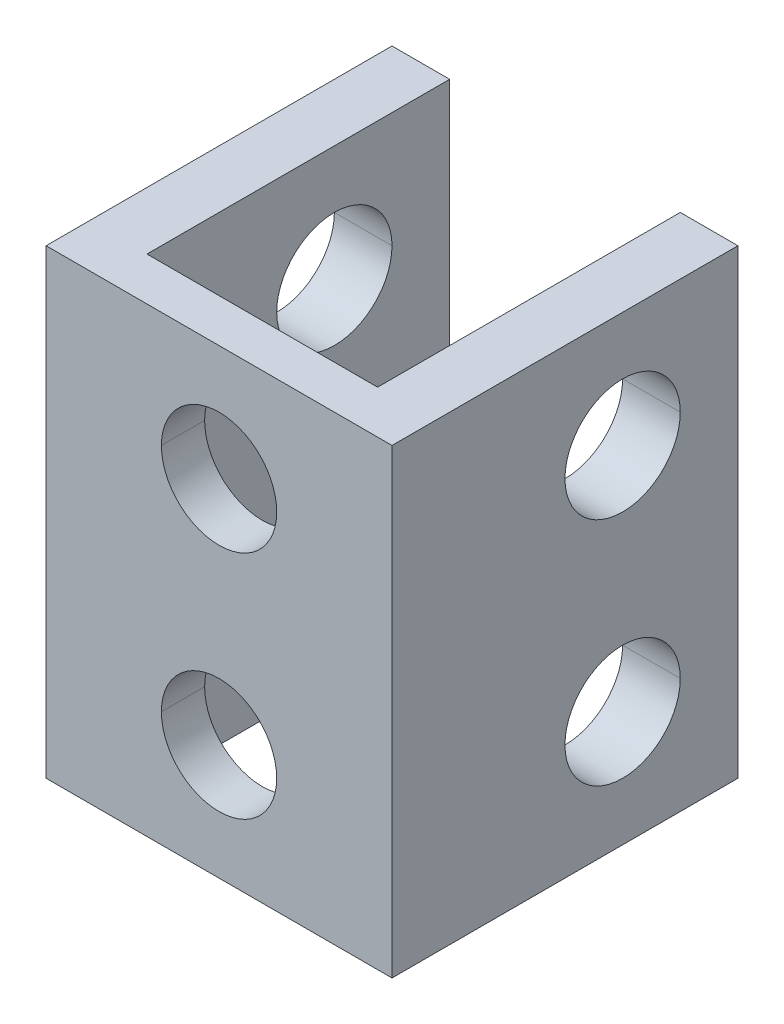
ISO-10303-21;
HEADER;
FILE_DESCRIPTION(('STEP AP214'),'2;1');
FILE_NAME('part.step','',(''),(''),'','','');
FILE_SCHEMA(('AUTOMOTIVE_DESIGN { 1 0 10303 214 1 1 1 1 }'));
ENDSEC;
DATA;
#1=APPLICATION_CONTEXT('core data for automotive mechanical design processes');
#2=APPLICATION_PROTOCOL_DEFINITION('international standard','automotive_design',2000,#1);
#3=PRODUCT_CONTEXT('',#1,'mechanical');
#4=PRODUCT('Part','Part','',(#3));
#5=PRODUCT_RELATED_PRODUCT_CATEGORY('part','',(#4));
#6=PRODUCT_DEFINITION_FORMATION('','',#4);
#7=PRODUCT_DEFINITION_CONTEXT('part definition',#1,'design');
#8=PRODUCT_DEFINITION('design','',#6,#7);
#9=PRODUCT_DEFINITION_SHAPE('','',#8);
#10=(LENGTH_UNIT() NAMED_UNIT(*) SI_UNIT(.MILLI.,.METRE.));
#11=(NAMED_UNIT(*) PLANE_ANGLE_UNIT() SI_UNIT($,.RADIAN.));
#12=(NAMED_UNIT(*) SI_UNIT($,.STERADIAN.) SOLID_ANGLE_UNIT());
#13=UNCERTAINTY_MEASURE_WITH_UNIT(LENGTH_MEASURE(1.E-05),#10,'distance_accuracy_value','');
#14=(GEOMETRIC_REPRESENTATION_CONTEXT(3) GLOBAL_UNCERTAINTY_ASSIGNED_CONTEXT((#13)) GLOBAL_UNIT_ASSIGNED_CONTEXT((#10,
#11,#12)) REPRESENTATION_CONTEXT('',''));
#15=CARTESIAN_POINT('',(0.,0.,0.));
#16=DIRECTION('',(0.,0.,1.));
#17=DIRECTION('',(1.,0.,0.));
#18=AXIS2_PLACEMENT_3D('',#15,#16,#17);
#19=CARTESIAN_POINT('',(0.,12.,1.5));
#20=DIRECTION('',(0.,0.,1.));
#21=DIRECTION('',(1.,0.,0.));
#22=AXIS2_PLACEMENT_3D('',#19,#20,#21);
#23=CYLINDRICAL_SURFACE('',#22,2.);
#24=DIRECTION('',(0.,0.,1.));
#25=VECTOR('',#24,1.);
#26=CARTESIAN_POINT('',(-2.,12.,1.5));
#27=LINE('',#26,#25);
#28=CARTESIAN_POINT('',(-2.,12.,0.));
#29=VERTEX_POINT('',#28);
#30=CARTESIAN_POINT('',(-2.,12.,1.5));
#31=VERTEX_POINT('',#30);
#32=EDGE_CURVE('E295',#29,#31,#27,.T.);
#33=ORIENTED_EDGE('',*,*,#32,.F.);
#34=CARTESIAN_POINT('',(0.,12.,0.));
#35=DIRECTION('',(0.,0.,1.));
#36=DIRECTION('',(1.,0.,0.));
#37=AXIS2_PLACEMENT_3D('',#34,#35,#36);
#38=CIRCLE('',#37,2.);
#39=CARTESIAN_POINT('',(2.,12.,0.));
#40=VERTEX_POINT('',#39);
#41=EDGE_CURVE('E26',#40,#29,#38,.T.);
#42=ORIENTED_EDGE('',*,*,#41,.F.);
#43=DIRECTION('',(0.,0.,1.));
#44=VECTOR('',#43,1.);
#45=CARTESIAN_POINT('',(2.,12.,1.5));
#46=LINE('',#45,#44);
#47=CARTESIAN_POINT('',(2.,12.,1.5));
#48=VERTEX_POINT('',#47);
#49=EDGE_CURVE('E271',#40,#48,#46,.T.);
#50=ORIENTED_EDGE('',*,*,#49,.T.);
#51=CARTESIAN_POINT('',(0.,12.,1.5));
#52=DIRECTION('',(0.,0.,1.));
#53=DIRECTION('',(1.,0.,0.));
#54=AXIS2_PLACEMENT_3D('',#51,#52,#53);
#55=CIRCLE('',#54,2.);
#56=EDGE_CURVE('E367',#48,#31,#55,.T.);
#57=ORIENTED_EDGE('',*,*,#56,.T.);
#58=EDGE_LOOP('',(#33,#42,#50,#57));
#59=FACE_BOUND('',#58,.T.);
#60=ADVANCED_FACE('F15',(#59),#23,.F.);
#61=CARTESIAN_POINT('',(-6.,12.,-6.5));
#62=DIRECTION('',(-1.,0.,0.));
#63=DIRECTION('',(0.,0.,1.));
#64=AXIS2_PLACEMENT_3D('',#61,#62,#63);
#65=CYLINDRICAL_SURFACE('',#64,2.);
#66=DIRECTION('',(-1.,0.,0.));
#67=VECTOR('',#66,1.);
#68=CARTESIAN_POINT('',(-6.,12.,-8.5));
#69=LINE('',#68,#67);
#70=CARTESIAN_POINT('',(6.,12.,-8.5));
#71=VERTEX_POINT('',#70);
#72=CARTESIAN_POINT('',(4.,12.,-8.5));
#73=VERTEX_POINT('',#72);
#74=EDGE_CURVE('E348',#71,#73,#69,.T.);
#75=ORIENTED_EDGE('',*,*,#74,.F.);
#76=CARTESIAN_POINT('',(6.,12.,-6.5));
#77=DIRECTION('',(-1.,0.,0.));
#78=DIRECTION('',(0.,0.,1.));
#79=AXIS2_PLACEMENT_3D('',#76,#77,#78);
#80=CIRCLE('',#79,2.);
#81=CARTESIAN_POINT('',(6.,12.,-4.5));
#82=VERTEX_POINT('',#81);
#83=EDGE_CURVE('E250',#82,#71,#80,.T.);
#84=ORIENTED_EDGE('',*,*,#83,.F.);
#85=DIRECTION('',(-1.,0.,0.));
#86=VECTOR('',#85,1.);
#87=CARTESIAN_POINT('',(-6.,12.,-4.5));
#88=LINE('',#87,#86);
#89=CARTESIAN_POINT('',(4.,12.,-4.5));
#90=VERTEX_POINT('',#89);
#91=EDGE_CURVE('E337',#82,#90,#88,.T.);
#92=ORIENTED_EDGE('',*,*,#91,.T.);
#93=CARTESIAN_POINT('',(4.,12.,-6.5));
#94=DIRECTION('',(1.,0.,0.));
#95=DIRECTION('',(0.,0.,-1.));
#96=AXIS2_PLACEMENT_3D('',#93,#94,#95);
#97=CIRCLE('',#96,2.);
#98=EDGE_CURVE('E341',#73,#90,#97,.T.);
#99=ORIENTED_EDGE('',*,*,#98,.F.);
#100=EDGE_LOOP('',(#75,#84,#92,#99));
#101=FACE_BOUND('',#100,.T.);
#102=ADVANCED_FACE('F481',(#101),#65,.F.);
#103=CARTESIAN_POINT('',(-6.,12.,-6.5));
#104=DIRECTION('',(-1.,0.,0.));
#105=DIRECTION('',(0.,0.,1.));
#106=AXIS2_PLACEMENT_3D('',#103,#104,#105);
#107=CYLINDRICAL_SURFACE('',#106,2.);
#108=DIRECTION('',(-1.,0.,0.));
#109=VECTOR('',#108,1.);
#110=CARTESIAN_POINT('',(-6.,12.,-8.5));
#111=LINE('',#110,#109);
#112=CARTESIAN_POINT('',(-4.,12.,-8.5));
#113=VERTEX_POINT('',#112);
#114=CARTESIAN_POINT('',(-6.,12.,-8.5));
#115=VERTEX_POINT('',#114);
#116=EDGE_CURVE('E266',#113,#115,#111,.T.);
#117=ORIENTED_EDGE('',*,*,#116,.F.);
#118=CARTESIAN_POINT('',(-4.,12.,-6.5));
#119=DIRECTION('',(-1.,0.,0.));
#120=DIRECTION('',(0.,0.,1.));
#121=AXIS2_PLACEMENT_3D('',#118,#119,#120);
#122=CIRCLE('',#121,2.);
#123=CARTESIAN_POINT('',(-4.,12.,-4.5));
#124=VERTEX_POINT('',#123);
#125=EDGE_CURVE('E185',#124,#113,#122,.T.);
#126=ORIENTED_EDGE('',*,*,#125,.F.);
#127=DIRECTION('',(-1.,0.,0.));
#128=VECTOR('',#127,1.);
#129=CARTESIAN_POINT('',(-6.,12.,-4.5));
#130=LINE('',#129,#128);
#131=CARTESIAN_POINT('',(-6.,12.,-4.5));
#132=VERTEX_POINT('',#131);
#133=EDGE_CURVE('E239',#124,#132,#130,.T.);
#134=ORIENTED_EDGE('',*,*,#133,.T.);
#135=CARTESIAN_POINT('',(-6.,12.,-6.5));
#136=DIRECTION('',(-1.,0.,0.));
#137=DIRECTION('',(0.,0.,1.));
#138=AXIS2_PLACEMENT_3D('',#135,#136,#137);
#139=CIRCLE('',#138,2.);
#140=EDGE_CURVE('E308',#132,#115,#139,.T.);
#141=ORIENTED_EDGE('',*,*,#140,.T.);
#142=EDGE_LOOP('',(#117,#126,#134,#141));
#143=FACE_BOUND('',#142,.T.);
#144=ADVANCED_FACE('F487',(#143),#107,.F.);
#145=CARTESIAN_POINT('',(0.,16.,0.));
#146=DIRECTION('',(0.,1.,0.));
#147=DIRECTION('',(1.,0.,0.));
#148=AXIS2_PLACEMENT_3D('',#145,#146,#147);
#149=PLANE('',#148);
#150=DIRECTION('',(0.,0.,-1.));
#151=VECTOR('',#150,1.);
#152=CARTESIAN_POINT('',(-4.,16.,0.));
#153=LINE('',#152,#151);
#154=CARTESIAN_POINT('',(-4.,16.,0.));
#155=VERTEX_POINT('',#154);
#156=CARTESIAN_POINT('',(-4.,16.,-10.5));
#157=VERTEX_POINT('',#156);
#158=EDGE_CURVE('E298',#155,#157,#153,.T.);
#159=ORIENTED_EDGE('',*,*,#158,.T.);
#160=DIRECTION('',(-1.,0.,0.));
#161=VECTOR('',#160,1.);
#162=CARTESIAN_POINT('',(-4.,16.,-10.5));
#163=LINE('',#162,#161);
#164=CARTESIAN_POINT('',(-6.,16.,-10.5));
#165=VERTEX_POINT('',#164);
#166=EDGE_CURVE('E240',#157,#165,#163,.T.);
#167=ORIENTED_EDGE('',*,*,#166,.T.);
#168=DIRECTION('',(0.,0.,1.));
#169=VECTOR('',#168,1.);
#170=CARTESIAN_POINT('',(-6.,16.,-10.5));
#171=LINE('',#170,#169);
#172=CARTESIAN_POINT('',(-6.,16.,1.5));
#173=VERTEX_POINT('',#172);
#174=EDGE_CURVE('E255',#165,#173,#171,.T.);
#175=ORIENTED_EDGE('',*,*,#174,.T.);
#176=DIRECTION('',(1.,0.,0.));
#177=VECTOR('',#176,1.);
#178=CARTESIAN_POINT('',(-6.,16.,1.5));
#179=LINE('',#178,#177);
#180=CARTESIAN_POINT('',(6.,16.,1.5));
#181=VERTEX_POINT('',#180);
#182=EDGE_CURVE('E259',#173,#181,#179,.T.);
#183=ORIENTED_EDGE('',*,*,#182,.T.);
#184=DIRECTION('',(0.,0.,-1.));
#185=VECTOR('',#184,1.);
#186=CARTESIAN_POINT('',(6.,16.,-10.5));
#187=LINE('',#186,#185);
#188=CARTESIAN_POINT('',(6.,16.,-10.5));
#189=VERTEX_POINT('',#188);
#190=EDGE_CURVE('E246',#181,#189,#187,.T.);
#191=ORIENTED_EDGE('',*,*,#190,.T.);
#192=DIRECTION('',(-1.,0.,0.));
#193=VECTOR('',#192,1.);
#194=CARTESIAN_POINT('',(4.,16.,-10.5));
#195=LINE('',#194,#193);
#196=CARTESIAN_POINT('',(4.,16.,-10.5));
#197=VERTEX_POINT('',#196);
#198=EDGE_CURVE('E315',#189,#197,#195,.T.);
#199=ORIENTED_EDGE('',*,*,#198,.T.);
#200=DIRECTION('',(0.,0.,1.));
#201=VECTOR('',#200,1.);
#202=CARTESIAN_POINT('',(4.,16.,0.));
#203=LINE('',#202,#201);
#204=CARTESIAN_POINT('',(4.,16.,0.));
#205=VERTEX_POINT('',#204);
#206=EDGE_CURVE('E229',#197,#205,#203,.T.);
#207=ORIENTED_EDGE('',*,*,#206,.T.);
#208=DIRECTION('',(-1.,0.,0.));
#209=VECTOR('',#208,1.);
#210=CARTESIAN_POINT('',(4.,16.,0.));
#211=LINE('',#210,#209);
#212=EDGE_CURVE('E41',#205,#155,#211,.T.);
#213=ORIENTED_EDGE('',*,*,#212,.T.);
#214=EDGE_LOOP('',(#159,#167,#175,#183,#191,#199,#207,#213));
#215=FACE_BOUND('',#214,.T.);
#216=ADVANCED_FACE('F524',(#215),#149,.T.);
#217=CARTESIAN_POINT('',(0.,4.,1.5));
#218=DIRECTION('',(0.,0.,1.));
#219=DIRECTION('',(1.,0.,0.));
#220=AXIS2_PLACEMENT_3D('',#217,#218,#219);
#221=CYLINDRICAL_SURFACE('',#220,2.);
#222=DIRECTION('',(0.,0.,1.));
#223=VECTOR('',#222,1.);
#224=CARTESIAN_POINT('',(-2.,4.,1.5));
#225=LINE('',#224,#223);
#226=CARTESIAN_POINT('',(-2.,4.,0.));
#227=VERTEX_POINT('',#226);
#228=CARTESIAN_POINT('',(-2.,4.,1.5));
#229=VERTEX_POINT('',#228);
#230=EDGE_CURVE('E215',#227,#229,#225,.T.);
#231=ORIENTED_EDGE('',*,*,#230,.F.);
#232=CARTESIAN_POINT('',(0.,4.,0.));
#233=DIRECTION('',(0.,0.,1.));
#234=DIRECTION('',(1.,0.,0.));
#235=AXIS2_PLACEMENT_3D('',#232,#233,#234);
#236=CIRCLE('',#235,2.);
#237=CARTESIAN_POINT('',(2.,4.,0.));
#238=VERTEX_POINT('',#237);
#239=EDGE_CURVE('E10',#238,#227,#236,.T.);
#240=ORIENTED_EDGE('',*,*,#239,.F.);
#241=DIRECTION('',(0.,0.,1.));
#242=VECTOR('',#241,1.);
#243=CARTESIAN_POINT('',(2.,4.,1.5));
#244=LINE('',#243,#242);
#245=CARTESIAN_POINT('',(2.,4.,1.5));
#246=VERTEX_POINT('',#245);
#247=EDGE_CURVE('E198',#238,#246,#244,.T.);
#248=ORIENTED_EDGE('',*,*,#247,.T.);
#249=CARTESIAN_POINT('',(0.,4.,1.5));
#250=DIRECTION('',(0.,0.,1.));
#251=DIRECTION('',(1.,0.,0.));
#252=AXIS2_PLACEMENT_3D('',#249,#250,#251);
#253=CIRCLE('',#252,2.);
#254=EDGE_CURVE('E225',#246,#229,#253,.T.);
#255=ORIENTED_EDGE('',*,*,#254,.T.);
#256=EDGE_LOOP('',(#231,#240,#248,#255));
#257=FACE_BOUND('',#256,.T.);
#258=ADVANCED_FACE('F419',(#257),#221,.F.);
#259=CARTESIAN_POINT('',(-6.,4.,-6.5));
#260=DIRECTION('',(-1.,0.,0.));
#261=DIRECTION('',(0.,0.,1.));
#262=AXIS2_PLACEMENT_3D('',#259,#260,#261);
#263=CYLINDRICAL_SURFACE('',#262,2.);
#264=DIRECTION('',(-1.,0.,0.));
#265=VECTOR('',#264,1.);
#266=CARTESIAN_POINT('',(-6.,4.,-8.5));
#267=LINE('',#266,#265);
#268=CARTESIAN_POINT('',(-4.,4.,-8.5));
#269=VERTEX_POINT('',#268);
#270=CARTESIAN_POINT('',(-6.,4.,-8.5));
#271=VERTEX_POINT('',#270);
#272=EDGE_CURVE('E179',#269,#271,#267,.T.);
#273=ORIENTED_EDGE('',*,*,#272,.F.);
#274=CARTESIAN_POINT('',(-4.,4.,-6.5));
#275=DIRECTION('',(-1.,0.,0.));
#276=DIRECTION('',(0.,0.,1.));
#277=AXIS2_PLACEMENT_3D('',#274,#275,#276);
#278=CIRCLE('',#277,2.);
#279=CARTESIAN_POINT('',(-4.,4.,-4.5));
#280=VERTEX_POINT('',#279);
#281=EDGE_CURVE('E173',#280,#269,#278,.T.);
#282=ORIENTED_EDGE('',*,*,#281,.F.);
#283=DIRECTION('',(-1.,0.,0.));
#284=VECTOR('',#283,1.);
#285=CARTESIAN_POINT('',(-6.,4.,-4.5));
#286=LINE('',#285,#284);
#287=CARTESIAN_POINT('',(-6.,4.,-4.5));
#288=VERTEX_POINT('',#287);
#289=EDGE_CURVE('E176',#280,#288,#286,.T.);
#290=ORIENTED_EDGE('',*,*,#289,.T.);
#291=CARTESIAN_POINT('',(-6.,4.,-6.5));
#292=DIRECTION('',(-1.,0.,0.));
#293=DIRECTION('',(0.,0.,1.));
#294=AXIS2_PLACEMENT_3D('',#291,#292,#293);
#295=CIRCLE('',#294,2.);
#296=EDGE_CURVE('E364',#288,#271,#295,.T.);
#297=ORIENTED_EDGE('',*,*,#296,.T.);
#298=EDGE_LOOP('',(#273,#282,#290,#297));
#299=FACE_BOUND('',#298,.T.);
#300=ADVANCED_FACE('F175',(#299),#263,.F.);
#301=CARTESIAN_POINT('',(-6.,4.,-6.5));
#302=DIRECTION('',(-1.,0.,0.));
#303=DIRECTION('',(0.,0.,1.));
#304=AXIS2_PLACEMENT_3D('',#301,#302,#303);
#305=CYLINDRICAL_SURFACE('',#304,2.);
#306=DIRECTION('',(-1.,0.,0.));
#307=VECTOR('',#306,1.);
#308=CARTESIAN_POINT('',(-6.,4.,-8.5));
#309=LINE('',#308,#307);
#310=CARTESIAN_POINT('',(6.,4.,-8.5));
#311=VERTEX_POINT('',#310);
#312=CARTESIAN_POINT('',(4.,4.,-8.5));
#313=VERTEX_POINT('',#312);
#314=EDGE_CURVE('E339',#311,#313,#309,.T.);
#315=ORIENTED_EDGE('',*,*,#314,.F.);
#316=CARTESIAN_POINT('',(6.,4.,-6.5));
#317=DIRECTION('',(-1.,0.,0.));
#318=DIRECTION('',(0.,0.,1.));
#319=AXIS2_PLACEMENT_3D('',#316,#317,#318);
#320=CIRCLE('',#319,2.);
#321=CARTESIAN_POINT('',(6.,4.,-4.5));
#322=VERTEX_POINT('',#321);
#323=EDGE_CURVE('E134',#322,#311,#320,.T.);
#324=ORIENTED_EDGE('',*,*,#323,.F.);
#325=DIRECTION('',(-1.,0.,0.));
#326=VECTOR('',#325,1.);
#327=CARTESIAN_POINT('',(-6.,4.,-4.5));
#328=LINE('',#327,#326);
#329=CARTESIAN_POINT('',(4.,4.,-4.5));
#330=VERTEX_POINT('',#329);
#331=EDGE_CURVE('E231',#322,#330,#328,.T.);
#332=ORIENTED_EDGE('',*,*,#331,.T.);
#333=CARTESIAN_POINT('',(4.,4.,-6.5));
#334=DIRECTION('',(1.,0.,0.));
#335=DIRECTION('',(0.,0.,-1.));
#336=AXIS2_PLACEMENT_3D('',#333,#334,#335);
#337=CIRCLE('',#336,2.);
#338=EDGE_CURVE('E123',#313,#330,#337,.T.);
#339=ORIENTED_EDGE('',*,*,#338,.F.);
#340=EDGE_LOOP('',(#315,#324,#332,#339));
#341=FACE_BOUND('',#340,.T.);
#342=ADVANCED_FACE('F497',(#341),#305,.F.);
#343=CARTESIAN_POINT('',(0.,0.,0.));
#344=DIRECTION('',(0.,1.,0.));
#345=DIRECTION('',(1.,0.,0.));
#346=AXIS2_PLACEMENT_3D('',#343,#344,#345);
#347=PLANE('',#346);
#348=DIRECTION('',(0.,0.,-1.));
#349=VECTOR('',#348,1.);
#350=CARTESIAN_POINT('',(-4.,0.,0.));
#351=LINE('',#350,#349);
#352=CARTESIAN_POINT('',(-4.,0.,0.));
#353=VERTEX_POINT('',#352);
#354=CARTESIAN_POINT('',(-4.,0.,-10.5));
#355=VERTEX_POINT('',#354);
#356=EDGE_CURVE('E234',#353,#355,#351,.T.);
#357=ORIENTED_EDGE('',*,*,#356,.F.);
#358=DIRECTION('',(-1.,0.,0.));
#359=VECTOR('',#358,1.);
#360=CARTESIAN_POINT('',(4.,0.,0.));
#361=LINE('',#360,#359);
#362=CARTESIAN_POINT('',(4.,0.,0.));
#363=VERTEX_POINT('',#362);
#364=EDGE_CURVE('E212',#363,#353,#361,.T.);
#365=ORIENTED_EDGE('',*,*,#364,.F.);
#366=DIRECTION('',(0.,0.,1.));
#367=VECTOR('',#366,1.);
#368=CARTESIAN_POINT('',(4.,0.,0.));
#369=LINE('',#368,#367);
#370=CARTESIAN_POINT('',(4.,0.,-10.5));
#371=VERTEX_POINT('',#370);
#372=EDGE_CURVE('E230',#371,#363,#369,.T.);
#373=ORIENTED_EDGE('',*,*,#372,.F.);
#374=DIRECTION('',(-1.,0.,0.));
#375=VECTOR('',#374,1.);
#376=CARTESIAN_POINT('',(4.,0.,-10.5));
#377=LINE('',#376,#375);
#378=CARTESIAN_POINT('',(6.,0.,-10.5));
#379=VERTEX_POINT('',#378);
#380=EDGE_CURVE('E316',#379,#371,#377,.T.);
#381=ORIENTED_EDGE('',*,*,#380,.F.);
#382=DIRECTION('',(0.,0.,-1.));
#383=VECTOR('',#382,1.);
#384=CARTESIAN_POINT('',(6.,0.,-10.5));
#385=LINE('',#384,#383);
#386=CARTESIAN_POINT('',(6.,0.,1.5));
#387=VERTEX_POINT('',#386);
#388=EDGE_CURVE('E220',#387,#379,#385,.T.);
#389=ORIENTED_EDGE('',*,*,#388,.F.);
#390=DIRECTION('',(1.,0.,0.));
#391=VECTOR('',#390,1.);
#392=CARTESIAN_POINT('',(-6.,0.,1.5));
#393=LINE('',#392,#391);
#394=CARTESIAN_POINT('',(-6.,0.,1.5));
#395=VERTEX_POINT('',#394);
#396=EDGE_CURVE('E260',#395,#387,#393,.T.);
#397=ORIENTED_EDGE('',*,*,#396,.F.);
#398=DIRECTION('',(0.,0.,1.));
#399=VECTOR('',#398,1.);
#400=CARTESIAN_POINT('',(-6.,0.,-10.5));
#401=LINE('',#400,#399);
#402=CARTESIAN_POINT('',(-6.,0.,-10.5));
#403=VERTEX_POINT('',#402);
#404=EDGE_CURVE('E244',#403,#395,#401,.T.);
#405=ORIENTED_EDGE('',*,*,#404,.F.);
#406=DIRECTION('',(-1.,0.,0.));
#407=VECTOR('',#406,1.);
#408=CARTESIAN_POINT('',(-4.,0.,-10.5));
#409=LINE('',#408,#407);
#410=EDGE_CURVE('E184',#355,#403,#409,.T.);
#411=ORIENTED_EDGE('',*,*,#410,.F.);
#412=EDGE_LOOP('',(#357,#365,#373,#381,#389,#397,#405,#411));
#413=FACE_BOUND('',#412,.T.);
#414=ADVANCED_FACE('F464',(#413),#347,.F.);
#415=CARTESIAN_POINT('',(4.,8.,0.));
#416=DIRECTION('',(0.,0.,1.));
#417=DIRECTION('',(1.,0.,0.));
#418=AXIS2_PLACEMENT_3D('',#415,#416,#417);
#419=PLANE('',#418);
#420=ORIENTED_EDGE('',*,*,#239,.T.);
#421=CARTESIAN_POINT('',(0.,4.,0.));
#422=DIRECTION('',(0.,0.,1.));
#423=DIRECTION('',(1.,0.,0.));
#424=AXIS2_PLACEMENT_3D('',#421,#422,#423);
#425=CIRCLE('',#424,2.);
#426=EDGE_CURVE('E219',#227,#238,#425,.T.);
#427=ORIENTED_EDGE('',*,*,#426,.T.);
#428=EDGE_LOOP('',(#420,#427));
#429=FACE_BOUND('',#428,.T.);
#430=ORIENTED_EDGE('',*,*,#41,.T.);
#431=CARTESIAN_POINT('',(0.,12.,0.));
#432=DIRECTION('',(0.,0.,1.));
#433=DIRECTION('',(1.,0.,0.));
#434=AXIS2_PLACEMENT_3D('',#431,#432,#433);
#435=CIRCLE('',#434,2.);
#436=EDGE_CURVE('E392',#29,#40,#435,.T.);
#437=ORIENTED_EDGE('',*,*,#436,.T.);
#438=EDGE_LOOP('',(#430,#437));
#439=FACE_BOUND('',#438,.T.);
#440=ORIENTED_EDGE('',*,*,#364,.T.);
#441=DIRECTION('',(0.,-1.,0.));
#442=VECTOR('',#441,1.);
#443=CARTESIAN_POINT('',(-4.,8.,0.));
#444=LINE('',#443,#442);
#445=EDGE_CURVE('E302',#155,#353,#444,.T.);
#446=ORIENTED_EDGE('',*,*,#445,.F.);
#447=ORIENTED_EDGE('',*,*,#212,.F.);
#448=DIRECTION('',(0.,-1.,0.));
#449=VECTOR('',#448,1.);
#450=CARTESIAN_POINT('',(4.,8.,0.));
#451=LINE('',#450,#449);
#452=EDGE_CURVE('E226',#205,#363,#451,.T.);
#453=ORIENTED_EDGE('',*,*,#452,.T.);
#454=EDGE_LOOP('',(#440,#446,#447,#453));
#455=FACE_BOUND('',#454,.T.);
#456=ADVANCED_FACE('F429',(#429,#439,#455),#419,.F.);
#457=CARTESIAN_POINT('',(4.,8.,0.));
#458=DIRECTION('',(1.,0.,0.));
#459=DIRECTION('',(0.,1.,0.));
#460=AXIS2_PLACEMENT_3D('',#457,#458,#459);
#461=PLANE('',#460);
#462=CARTESIAN_POINT('',(4.,4.,-6.5));
#463=DIRECTION('',(1.,0.,0.));
#464=DIRECTION('',(0.,0.,-1.));
#465=AXIS2_PLACEMENT_3D('',#462,#463,#464);
#466=CIRCLE('',#465,2.);
#467=EDGE_CURVE('E235',#330,#313,#466,.T.);
#468=ORIENTED_EDGE('',*,*,#467,.T.);
#469=ORIENTED_EDGE('',*,*,#338,.T.);
#470=EDGE_LOOP('',(#468,#469));
#471=FACE_BOUND('',#470,.T.);
#472=CARTESIAN_POINT('',(4.,12.,-6.5));
#473=DIRECTION('',(1.,0.,0.));
#474=DIRECTION('',(0.,0.,-1.));
#475=AXIS2_PLACEMENT_3D('',#472,#473,#474);
#476=CIRCLE('',#475,2.);
#477=EDGE_CURVE('E344',#90,#73,#476,.T.);
#478=ORIENTED_EDGE('',*,*,#477,.T.);
#479=ORIENTED_EDGE('',*,*,#98,.T.);
#480=EDGE_LOOP('',(#478,#479));
#481=FACE_BOUND('',#480,.T.);
#482=ORIENTED_EDGE('',*,*,#372,.T.);
#483=ORIENTED_EDGE('',*,*,#452,.F.);
#484=ORIENTED_EDGE('',*,*,#206,.F.);
#485=DIRECTION('',(0.,-1.,0.));
#486=VECTOR('',#485,1.);
#487=CARTESIAN_POINT('',(4.,8.,-10.5));
#488=LINE('',#487,#486);
#489=EDGE_CURVE('E311',#197,#371,#488,.T.);
#490=ORIENTED_EDGE('',*,*,#489,.T.);
#491=EDGE_LOOP('',(#482,#483,#484,#490));
#492=FACE_BOUND('',#491,.T.);
#493=ADVANCED_FACE('F516',(#471,#481,#492),#461,.F.);
#494=CARTESIAN_POINT('',(4.,8.,-10.5));
#495=DIRECTION('',(0.,0.,1.));
#496=DIRECTION('',(1.,0.,0.));
#497=AXIS2_PLACEMENT_3D('',#494,#495,#496);
#498=PLANE('',#497);
#499=ORIENTED_EDGE('',*,*,#380,.T.);
#500=ORIENTED_EDGE('',*,*,#489,.F.);
#501=ORIENTED_EDGE('',*,*,#198,.F.);
#502=DIRECTION('',(0.,-1.,0.));
#503=VECTOR('',#502,1.);
#504=CARTESIAN_POINT('',(6.,8.,-10.5));
#505=LINE('',#504,#503);
#506=EDGE_CURVE('E224',#189,#379,#505,.T.);
#507=ORIENTED_EDGE('',*,*,#506,.T.);
#508=EDGE_LOOP('',(#499,#500,#501,#507));
#509=FACE_BOUND('',#508,.T.);
#510=ADVANCED_FACE('F513',(#509),#498,.F.);
#511=CARTESIAN_POINT('',(6.,8.,-10.5));
#512=DIRECTION('',(-1.,0.,0.));
#513=DIRECTION('',(0.,0.,1.));
#514=AXIS2_PLACEMENT_3D('',#511,#512,#513);
#515=PLANE('',#514);
#516=ORIENTED_EDGE('',*,*,#323,.T.);
#517=CARTESIAN_POINT('',(6.,4.,-6.5));
#518=DIRECTION('',(-1.,0.,0.));
#519=DIRECTION('',(0.,0.,1.));
#520=AXIS2_PLACEMENT_3D('',#517,#518,#519);
#521=CIRCLE('',#520,2.);
#522=EDGE_CURVE('E193',#311,#322,#521,.T.);
#523=ORIENTED_EDGE('',*,*,#522,.T.);
#524=EDGE_LOOP('',(#516,#523));
#525=FACE_BOUND('',#524,.T.);
#526=ORIENTED_EDGE('',*,*,#83,.T.);
#527=CARTESIAN_POINT('',(6.,12.,-6.5));
#528=DIRECTION('',(-1.,0.,0.));
#529=DIRECTION('',(0.,0.,1.));
#530=AXIS2_PLACEMENT_3D('',#527,#528,#529);
#531=CIRCLE('',#530,2.);
#532=EDGE_CURVE('E274',#71,#82,#531,.T.);
#533=ORIENTED_EDGE('',*,*,#532,.T.);
#534=EDGE_LOOP('',(#526,#533));
#535=FACE_BOUND('',#534,.T.);
#536=ORIENTED_EDGE('',*,*,#388,.T.);
#537=ORIENTED_EDGE('',*,*,#506,.F.);
#538=ORIENTED_EDGE('',*,*,#190,.F.);
#539=DIRECTION('',(0.,-1.,0.));
#540=VECTOR('',#539,1.);
#541=CARTESIAN_POINT('',(6.,8.,1.5));
#542=LINE('',#541,#540);
#543=EDGE_CURVE('E256',#181,#387,#542,.T.);
#544=ORIENTED_EDGE('',*,*,#543,.T.);
#545=EDGE_LOOP('',(#536,#537,#538,#544));
#546=FACE_BOUND('',#545,.T.);
#547=ADVANCED_FACE('F508',(#525,#535,#546),#515,.F.);
#548=CARTESIAN_POINT('',(-6.,8.,1.5));
#549=DIRECTION('',(0.,0.,-1.));
#550=DIRECTION('',(0.,-1.,0.));
#551=AXIS2_PLACEMENT_3D('',#548,#549,#550);
#552=PLANE('',#551);
#553=ORIENTED_EDGE('',*,*,#254,.F.);
#554=CARTESIAN_POINT('',(0.,4.,1.5));
#555=DIRECTION('',(0.,0.,1.));
#556=DIRECTION('',(1.,0.,0.));
#557=AXIS2_PLACEMENT_3D('',#554,#555,#556);
#558=CIRCLE('',#557,2.);
#559=EDGE_CURVE('E208',#229,#246,#558,.T.);
#560=ORIENTED_EDGE('',*,*,#559,.F.);
#561=EDGE_LOOP('',(#553,#560));
#562=FACE_BOUND('',#561,.T.);
#563=ORIENTED_EDGE('',*,*,#56,.F.);
#564=CARTESIAN_POINT('',(0.,12.,1.5));
#565=DIRECTION('',(0.,0.,1.));
#566=DIRECTION('',(1.,0.,0.));
#567=AXIS2_PLACEMENT_3D('',#564,#565,#566);
#568=CIRCLE('',#567,2.);
#569=EDGE_CURVE('E275',#31,#48,#568,.T.);
#570=ORIENTED_EDGE('',*,*,#569,.F.);
#571=EDGE_LOOP('',(#563,#570));
#572=FACE_BOUND('',#571,.T.);
#573=ORIENTED_EDGE('',*,*,#396,.T.);
#574=ORIENTED_EDGE('',*,*,#543,.F.);
#575=ORIENTED_EDGE('',*,*,#182,.F.);
#576=DIRECTION('',(0.,-1.,0.));
#577=VECTOR('',#576,1.);
#578=CARTESIAN_POINT('',(-6.,8.,1.5));
#579=LINE('',#578,#577);
#580=EDGE_CURVE('E251',#173,#395,#579,.T.);
#581=ORIENTED_EDGE('',*,*,#580,.T.);
#582=EDGE_LOOP('',(#573,#574,#575,#581));
#583=FACE_BOUND('',#582,.T.);
#584=ADVANCED_FACE('F424',(#562,#572,#583),#552,.F.);
#585=CARTESIAN_POINT('',(-6.,8.,-10.5));
#586=DIRECTION('',(1.,0.,0.));
#587=DIRECTION('',(0.,0.,-1.));
#588=AXIS2_PLACEMENT_3D('',#585,#586,#587);
#589=PLANE('',#588);
#590=ORIENTED_EDGE('',*,*,#296,.F.);
#591=CARTESIAN_POINT('',(-6.,4.,-6.5));
#592=DIRECTION('',(-1.,0.,0.));
#593=DIRECTION('',(0.,0.,1.));
#594=AXIS2_PLACEMENT_3D('',#591,#592,#593);
#595=CIRCLE('',#594,2.);
#596=EDGE_CURVE('E191',#271,#288,#595,.T.);
#597=ORIENTED_EDGE('',*,*,#596,.F.);
#598=EDGE_LOOP('',(#590,#597));
#599=FACE_BOUND('',#598,.T.);
#600=ORIENTED_EDGE('',*,*,#140,.F.);
#601=CARTESIAN_POINT('',(-6.,12.,-6.5));
#602=DIRECTION('',(-1.,0.,0.));
#603=DIRECTION('',(0.,0.,1.));
#604=AXIS2_PLACEMENT_3D('',#601,#602,#603);
#605=CIRCLE('',#604,2.);
#606=EDGE_CURVE('E262',#115,#132,#605,.T.);
#607=ORIENTED_EDGE('',*,*,#606,.F.);
#608=EDGE_LOOP('',(#600,#607));
#609=FACE_BOUND('',#608,.T.);
#610=ORIENTED_EDGE('',*,*,#404,.T.);
#611=ORIENTED_EDGE('',*,*,#580,.F.);
#612=ORIENTED_EDGE('',*,*,#174,.F.);
#613=DIRECTION('',(0.,-1.,0.));
#614=VECTOR('',#613,1.);
#615=CARTESIAN_POINT('',(-6.,8.,-10.5));
#616=LINE('',#615,#614);
#617=EDGE_CURVE('E245',#165,#403,#616,.T.);
#618=ORIENTED_EDGE('',*,*,#617,.T.);
#619=EDGE_LOOP('',(#610,#611,#612,#618));
#620=FACE_BOUND('',#619,.T.);
#621=ADVANCED_FACE('F477',(#599,#609,#620),#589,.F.);
#622=CARTESIAN_POINT('',(-4.,8.,-10.5));
#623=DIRECTION('',(0.,0.,1.));
#624=DIRECTION('',(1.,0.,0.));
#625=AXIS2_PLACEMENT_3D('',#622,#623,#624);
#626=PLANE('',#625);
#627=ORIENTED_EDGE('',*,*,#410,.T.);
#628=ORIENTED_EDGE('',*,*,#617,.F.);
#629=ORIENTED_EDGE('',*,*,#166,.F.);
#630=DIRECTION('',(0.,-1.,0.));
#631=VECTOR('',#630,1.);
#632=CARTESIAN_POINT('',(-4.,8.,-10.5));
#633=LINE('',#632,#631);
#634=EDGE_CURVE('E270',#157,#355,#633,.T.);
#635=ORIENTED_EDGE('',*,*,#634,.T.);
#636=EDGE_LOOP('',(#627,#628,#629,#635));
#637=FACE_BOUND('',#636,.T.);
#638=ADVANCED_FACE('F466',(#637),#626,.F.);
#639=CARTESIAN_POINT('',(-4.,8.,0.));
#640=DIRECTION('',(-1.,0.,0.));
#641=DIRECTION('',(0.,0.,1.));
#642=AXIS2_PLACEMENT_3D('',#639,#640,#641);
#643=PLANE('',#642);
#644=ORIENTED_EDGE('',*,*,#281,.T.);
#645=CARTESIAN_POINT('',(-4.,4.,-6.5));
#646=DIRECTION('',(-1.,0.,0.));
#647=DIRECTION('',(0.,0.,1.));
#648=AXIS2_PLACEMENT_3D('',#645,#646,#647);
#649=CIRCLE('',#648,2.);
#650=EDGE_CURVE('E189',#269,#280,#649,.T.);
#651=ORIENTED_EDGE('',*,*,#650,.T.);
#652=EDGE_LOOP('',(#644,#651));
#653=FACE_BOUND('',#652,.T.);
#654=ORIENTED_EDGE('',*,*,#125,.T.);
#655=CARTESIAN_POINT('',(-4.,12.,-6.5));
#656=DIRECTION('',(-1.,0.,0.));
#657=DIRECTION('',(0.,0.,1.));
#658=AXIS2_PLACEMENT_3D('',#655,#656,#657);
#659=CIRCLE('',#658,2.);
#660=EDGE_CURVE('E19',#113,#124,#659,.T.);
#661=ORIENTED_EDGE('',*,*,#660,.T.);
#662=EDGE_LOOP('',(#654,#661));
#663=FACE_BOUND('',#662,.T.);
#664=ORIENTED_EDGE('',*,*,#356,.T.);
#665=ORIENTED_EDGE('',*,*,#634,.F.);
#666=ORIENTED_EDGE('',*,*,#158,.F.);
#667=ORIENTED_EDGE('',*,*,#445,.T.);
#668=EDGE_LOOP('',(#664,#665,#666,#667));
#669=FACE_BOUND('',#668,.T.);
#670=ADVANCED_FACE('F195',(#653,#663,#669),#643,.F.);
#671=CARTESIAN_POINT('',(-6.,4.,-6.5));
#672=DIRECTION('',(-1.,0.,0.));
#673=DIRECTION('',(0.,0.,1.));
#674=AXIS2_PLACEMENT_3D('',#671,#672,#673);
#675=CYLINDRICAL_SURFACE('',#674,2.);
#676=ORIENTED_EDGE('',*,*,#522,.F.);
#677=ORIENTED_EDGE('',*,*,#314,.T.);
#678=ORIENTED_EDGE('',*,*,#467,.F.);
#679=ORIENTED_EDGE('',*,*,#331,.F.);
#680=EDGE_LOOP('',(#676,#677,#678,#679));
#681=FACE_BOUND('',#680,.T.);
#682=ADVANCED_FACE('F468',(#681),#675,.F.);
#683=CARTESIAN_POINT('',(-6.,4.,-6.5));
#684=DIRECTION('',(-1.,0.,0.));
#685=DIRECTION('',(0.,0.,1.));
#686=AXIS2_PLACEMENT_3D('',#683,#684,#685);
#687=CYLINDRICAL_SURFACE('',#686,2.);
#688=ORIENTED_EDGE('',*,*,#650,.F.);
#689=ORIENTED_EDGE('',*,*,#272,.T.);
#690=ORIENTED_EDGE('',*,*,#596,.T.);
#691=ORIENTED_EDGE('',*,*,#289,.F.);
#692=EDGE_LOOP('',(#688,#689,#690,#691));
#693=FACE_BOUND('',#692,.T.);
#694=ADVANCED_FACE('F188',(#693),#687,.F.);
#695=CARTESIAN_POINT('',(0.,4.,1.5));
#696=DIRECTION('',(0.,0.,1.));
#697=DIRECTION('',(1.,0.,0.));
#698=AXIS2_PLACEMENT_3D('',#695,#696,#697);
#699=CYLINDRICAL_SURFACE('',#698,2.);
#700=ORIENTED_EDGE('',*,*,#426,.F.);
#701=ORIENTED_EDGE('',*,*,#230,.T.);
#702=ORIENTED_EDGE('',*,*,#559,.T.);
#703=ORIENTED_EDGE('',*,*,#247,.F.);
#704=EDGE_LOOP('',(#700,#701,#702,#703));
#705=FACE_BOUND('',#704,.T.);
#706=ADVANCED_FACE('F427',(#705),#699,.F.);
#707=CARTESIAN_POINT('',(-6.,12.,-6.5));
#708=DIRECTION('',(-1.,0.,0.));
#709=DIRECTION('',(0.,0.,1.));
#710=AXIS2_PLACEMENT_3D('',#707,#708,#709);
#711=CYLINDRICAL_SURFACE('',#710,2.);
#712=ORIENTED_EDGE('',*,*,#660,.F.);
#713=ORIENTED_EDGE('',*,*,#116,.T.);
#714=ORIENTED_EDGE('',*,*,#606,.T.);
#715=ORIENTED_EDGE('',*,*,#133,.F.);
#716=EDGE_LOOP('',(#712,#713,#714,#715));
#717=FACE_BOUND('',#716,.T.);
#718=ADVANCED_FACE('F17',(#717),#711,.F.);
#719=CARTESIAN_POINT('',(-6.,12.,-6.5));
#720=DIRECTION('',(-1.,0.,0.));
#721=DIRECTION('',(0.,0.,1.));
#722=AXIS2_PLACEMENT_3D('',#719,#720,#721);
#723=CYLINDRICAL_SURFACE('',#722,2.);
#724=ORIENTED_EDGE('',*,*,#532,.F.);
#725=ORIENTED_EDGE('',*,*,#74,.T.);
#726=ORIENTED_EDGE('',*,*,#477,.F.);
#727=ORIENTED_EDGE('',*,*,#91,.F.);
#728=EDGE_LOOP('',(#724,#725,#726,#727));
#729=FACE_BOUND('',#728,.T.);
#730=ADVANCED_FACE('F504',(#729),#723,.F.);
#731=CARTESIAN_POINT('',(0.,12.,1.5));
#732=DIRECTION('',(0.,0.,1.));
#733=DIRECTION('',(1.,0.,0.));
#734=AXIS2_PLACEMENT_3D('',#731,#732,#733);
#735=CYLINDRICAL_SURFACE('',#734,2.);
#736=ORIENTED_EDGE('',*,*,#436,.F.);
#737=ORIENTED_EDGE('',*,*,#32,.T.);
#738=ORIENTED_EDGE('',*,*,#569,.T.);
#739=ORIENTED_EDGE('',*,*,#49,.F.);
#740=EDGE_LOOP('',(#736,#737,#738,#739));
#741=FACE_BOUND('',#740,.T.);
#742=ADVANCED_FACE('F501',(#741),#735,.F.);
#743=CLOSED_SHELL('',(#60,#102,#144,#216,#258,#300,#342,#414,#456,#493,#510,#547,#584,#621,#638,
#670,#682,#694,#706,#718,#730,#742));
#744=MANIFOLD_SOLID_BREP('B1',#743);
#745=ADVANCED_BREP_SHAPE_REPRESENTATION('',(#18,#744),#14);
#746=SHAPE_DEFINITION_REPRESENTATION(#9,#745);
ENDSEC;
END-ISO-10303-21;
